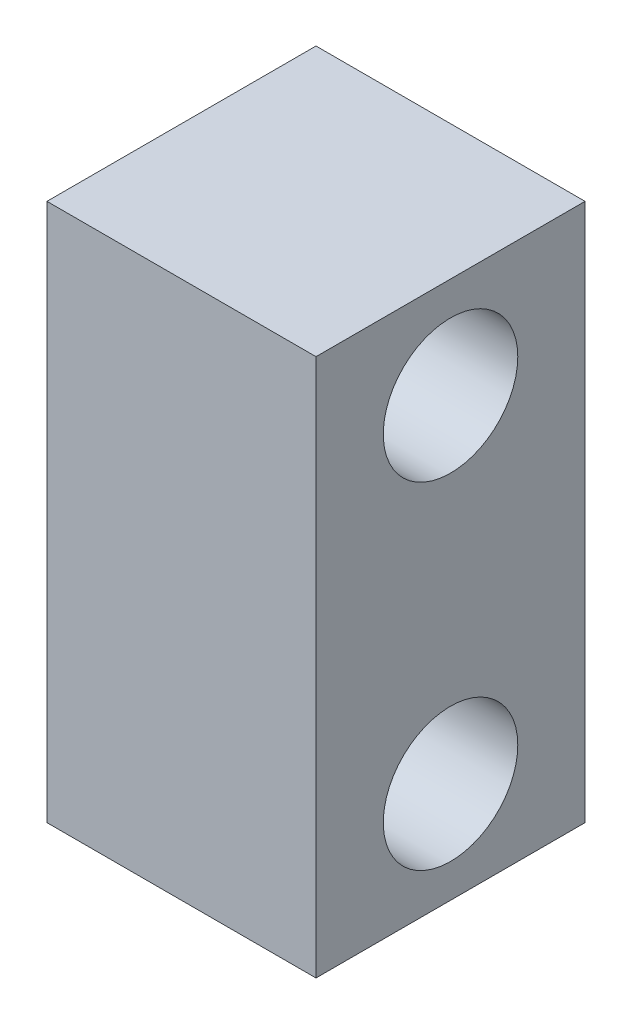
ISO-10303-21;
HEADER;
FILE_DESCRIPTION(('STEP AP214'),'2;1');
FILE_NAME('part.step','',(''),(''),'','','');
FILE_SCHEMA(('AUTOMOTIVE_DESIGN { 1 0 10303 214 1 1 1 1 }'));
ENDSEC;
DATA;
#1=APPLICATION_CONTEXT('core data for automotive mechanical design processes');
#2=APPLICATION_PROTOCOL_DEFINITION('international standard','automotive_design',2000,#1);
#3=PRODUCT_CONTEXT('',#1,'mechanical');
#4=PRODUCT('Part','Part','',(#3));
#5=PRODUCT_RELATED_PRODUCT_CATEGORY('part','',(#4));
#6=PRODUCT_DEFINITION_FORMATION('','',#4);
#7=PRODUCT_DEFINITION_CONTEXT('part definition',#1,'design');
#8=PRODUCT_DEFINITION('design','',#6,#7);
#9=PRODUCT_DEFINITION_SHAPE('','',#8);
#10=(LENGTH_UNIT() NAMED_UNIT(*) SI_UNIT(.MILLI.,.METRE.));
#11=(NAMED_UNIT(*) PLANE_ANGLE_UNIT() SI_UNIT($,.RADIAN.));
#12=(NAMED_UNIT(*) SI_UNIT($,.STERADIAN.) SOLID_ANGLE_UNIT());
#13=UNCERTAINTY_MEASURE_WITH_UNIT(LENGTH_MEASURE(1.E-05),#10,'distance_accuracy_value','');
#14=(GEOMETRIC_REPRESENTATION_CONTEXT(3) GLOBAL_UNCERTAINTY_ASSIGNED_CONTEXT((#13)) GLOBAL_UNIT_ASSIGNED_CONTEXT((#10,
#11,#12)) REPRESENTATION_CONTEXT('',''));
#15=CARTESIAN_POINT('',(0.,0.,0.));
#16=DIRECTION('',(0.,0.,1.));
#17=DIRECTION('',(1.,0.,0.));
#18=AXIS2_PLACEMENT_3D('',#15,#16,#17);
#19=CARTESIAN_POINT('',(0.,0.,50.8));
#20=DIRECTION('',(1.,0.,0.));
#21=DIRECTION('',(0.,0.,-1.));
#22=AXIS2_PLACEMENT_3D('',#19,#20,#21);
#23=PLANE('',#22);
#24=CARTESIAN_POINT('',(0.,82.55,25.4));
#25=DIRECTION('',(1.,0.,0.));
#26=DIRECTION('',(0.,0.,-1.));
#27=AXIS2_PLACEMENT_3D('',#24,#25,#26);
#28=CIRCLE('',#27,12.7);
#29=CARTESIAN_POINT('',(0.,82.55,12.7));
#30=VERTEX_POINT('',#29);
#31=EDGE_CURVE('E111',#30,#30,#28,.T.);
#32=ORIENTED_EDGE('',*,*,#31,.T.);
#33=EDGE_LOOP('',(#32));
#34=FACE_BOUND('',#33,.T.);
#35=CARTESIAN_POINT('',(0.,19.05,25.4));
#36=DIRECTION('',(1.,0.,0.));
#37=DIRECTION('',(0.,0.,-1.));
#38=AXIS2_PLACEMENT_3D('',#35,#36,#37);
#39=CIRCLE('',#38,12.7);
#40=CARTESIAN_POINT('',(0.,19.05,12.7));
#41=VERTEX_POINT('',#40);
#42=EDGE_CURVE('E132',#41,#41,#39,.T.);
#43=ORIENTED_EDGE('',*,*,#42,.T.);
#44=EDGE_LOOP('',(#43));
#45=FACE_BOUND('',#44,.T.);
#46=DIRECTION('',(0.,-1.,0.));
#47=VECTOR('',#46,1.);
#48=CARTESIAN_POINT('',(0.,0.,0.));
#49=LINE('',#48,#47);
#50=CARTESIAN_POINT('',(0.,101.6,0.));
#51=VERTEX_POINT('',#50);
#52=CARTESIAN_POINT('',(0.,0.,0.));
#53=VERTEX_POINT('',#52);
#54=EDGE_CURVE('E107',#51,#53,#49,.T.);
#55=ORIENTED_EDGE('',*,*,#54,.T.);
#56=DIRECTION('',(0.,0.,-1.));
#57=VECTOR('',#56,1.);
#58=CARTESIAN_POINT('',(0.,0.,50.8));
#59=LINE('',#58,#57);
#60=CARTESIAN_POINT('',(0.,0.,50.8));
#61=VERTEX_POINT('',#60);
#62=EDGE_CURVE('E11',#61,#53,#59,.T.);
#63=ORIENTED_EDGE('',*,*,#62,.F.);
#64=DIRECTION('',(0.,-1.,0.));
#65=VECTOR('',#64,1.);
#66=CARTESIAN_POINT('',(0.,0.,50.8));
#67=LINE('',#66,#65);
#68=CARTESIAN_POINT('',(0.,101.6,50.8));
#69=VERTEX_POINT('',#68);
#70=EDGE_CURVE('E91',#69,#61,#67,.T.);
#71=ORIENTED_EDGE('',*,*,#70,.F.);
#72=DIRECTION('',(0.,0.,-1.));
#73=VECTOR('',#72,1.);
#74=CARTESIAN_POINT('',(0.,101.6,50.8));
#75=LINE('',#74,#73);
#76=EDGE_CURVE('E103',#69,#51,#75,.T.);
#77=ORIENTED_EDGE('',*,*,#76,.T.);
#78=EDGE_LOOP('',(#55,#63,#71,#77));
#79=FACE_BOUND('',#78,.T.);
#80=ADVANCED_FACE('F39',(#34,#45,#79),#23,.F.);
#81=CARTESIAN_POINT('',(0.,0.,50.8));
#82=DIRECTION('',(0.,1.,0.));
#83=DIRECTION('',(0.,0.,1.));
#84=AXIS2_PLACEMENT_3D('',#81,#82,#83);
#85=PLANE('',#84);
#86=DIRECTION('',(1.,0.,0.));
#87=VECTOR('',#86,1.);
#88=CARTESIAN_POINT('',(0.,0.,0.));
#89=LINE('',#88,#87);
#90=CARTESIAN_POINT('',(50.8,0.,0.));
#91=VERTEX_POINT('',#90);
#92=EDGE_CURVE('E96',#53,#91,#89,.T.);
#93=ORIENTED_EDGE('',*,*,#92,.T.);
#94=DIRECTION('',(0.,0.,-1.));
#95=VECTOR('',#94,1.);
#96=CARTESIAN_POINT('',(50.8,0.,50.8));
#97=LINE('',#96,#95);
#98=CARTESIAN_POINT('',(50.8,0.,50.8));
#99=VERTEX_POINT('',#98);
#100=EDGE_CURVE('E48',#99,#91,#97,.T.);
#101=ORIENTED_EDGE('',*,*,#100,.F.);
#102=DIRECTION('',(1.,0.,0.));
#103=VECTOR('',#102,1.);
#104=CARTESIAN_POINT('',(0.,0.,50.8));
#105=LINE('',#104,#103);
#106=EDGE_CURVE('E86',#61,#99,#105,.T.);
#107=ORIENTED_EDGE('',*,*,#106,.F.);
#108=ORIENTED_EDGE('',*,*,#62,.T.);
#109=EDGE_LOOP('',(#93,#101,#107,#108));
#110=FACE_BOUND('',#109,.T.);
#111=ADVANCED_FACE('F95',(#110),#85,.F.);
#112=CARTESIAN_POINT('',(50.8,0.,50.8));
#113=DIRECTION('',(-1.,0.,0.));
#114=DIRECTION('',(0.,0.,1.));
#115=AXIS2_PLACEMENT_3D('',#112,#113,#114);
#116=PLANE('',#115);
#117=CARTESIAN_POINT('',(50.8,82.55,25.4));
#118=DIRECTION('',(1.,0.,0.));
#119=DIRECTION('',(0.,0.,-1.));
#120=AXIS2_PLACEMENT_3D('',#117,#118,#119);
#121=CIRCLE('',#120,12.7);
#122=CARTESIAN_POINT('',(50.8,82.55,12.7));
#123=VERTEX_POINT('',#122);
#124=EDGE_CURVE('E136',#123,#123,#121,.T.);
#125=ORIENTED_EDGE('',*,*,#124,.F.);
#126=EDGE_LOOP('',(#125));
#127=FACE_BOUND('',#126,.T.);
#128=CARTESIAN_POINT('',(50.8,19.05,25.4));
#129=DIRECTION('',(1.,0.,0.));
#130=DIRECTION('',(0.,0.,-1.));
#131=AXIS2_PLACEMENT_3D('',#128,#129,#130);
#132=CIRCLE('',#131,12.7);
#133=CARTESIAN_POINT('',(50.8,19.05,12.7));
#134=VERTEX_POINT('',#133);
#135=EDGE_CURVE('E128',#134,#134,#132,.T.);
#136=ORIENTED_EDGE('',*,*,#135,.F.);
#137=EDGE_LOOP('',(#136));
#138=FACE_BOUND('',#137,.T.);
#139=DIRECTION('',(0.,1.,0.));
#140=VECTOR('',#139,1.);
#141=CARTESIAN_POINT('',(50.8,0.,0.));
#142=LINE('',#141,#140);
#143=CARTESIAN_POINT('',(50.8,101.6,0.));
#144=VERTEX_POINT('',#143);
#145=EDGE_CURVE('E73',#91,#144,#142,.T.);
#146=ORIENTED_EDGE('',*,*,#145,.T.);
#147=DIRECTION('',(0.,0.,-1.));
#148=VECTOR('',#147,1.);
#149=CARTESIAN_POINT('',(50.8,101.6,50.8));
#150=LINE('',#149,#148);
#151=CARTESIAN_POINT('',(50.8,101.6,50.8));
#152=VERTEX_POINT('',#151);
#153=EDGE_CURVE('E98',#152,#144,#150,.T.);
#154=ORIENTED_EDGE('',*,*,#153,.F.);
#155=DIRECTION('',(0.,1.,0.));
#156=VECTOR('',#155,1.);
#157=CARTESIAN_POINT('',(50.8,0.,50.8));
#158=LINE('',#157,#156);
#159=EDGE_CURVE('E89',#99,#152,#158,.T.);
#160=ORIENTED_EDGE('',*,*,#159,.F.);
#161=ORIENTED_EDGE('',*,*,#100,.T.);
#162=EDGE_LOOP('',(#146,#154,#160,#161));
#163=FACE_BOUND('',#162,.T.);
#164=ADVANCED_FACE('F99',(#127,#138,#163),#116,.F.);
#165=CARTESIAN_POINT('',(0.,101.6,50.8));
#166=DIRECTION('',(0.,-1.,0.));
#167=DIRECTION('',(0.,0.,-1.));
#168=AXIS2_PLACEMENT_3D('',#165,#166,#167);
#169=PLANE('',#168);
#170=DIRECTION('',(-1.,0.,0.));
#171=VECTOR('',#170,1.);
#172=CARTESIAN_POINT('',(0.,101.6,0.));
#173=LINE('',#172,#171);
#174=EDGE_CURVE('E79',#144,#51,#173,.T.);
#175=ORIENTED_EDGE('',*,*,#174,.T.);
#176=ORIENTED_EDGE('',*,*,#76,.F.);
#177=DIRECTION('',(-1.,0.,0.));
#178=VECTOR('',#177,1.);
#179=CARTESIAN_POINT('',(0.,101.6,50.8));
#180=LINE('',#179,#178);
#181=EDGE_CURVE('E56',#152,#69,#180,.T.);
#182=ORIENTED_EDGE('',*,*,#181,.F.);
#183=ORIENTED_EDGE('',*,*,#153,.T.);
#184=EDGE_LOOP('',(#175,#176,#182,#183));
#185=FACE_BOUND('',#184,.T.);
#186=ADVANCED_FACE('F121',(#185),#169,.F.);
#187=CARTESIAN_POINT('',(0.,0.,50.8));
#188=DIRECTION('',(0.,0.,-1.));
#189=DIRECTION('',(-1.,0.,0.));
#190=AXIS2_PLACEMENT_3D('',#187,#188,#189);
#191=PLANE('',#190);
#192=ORIENTED_EDGE('',*,*,#70,.T.);
#193=ORIENTED_EDGE('',*,*,#106,.T.);
#194=ORIENTED_EDGE('',*,*,#159,.T.);
#195=ORIENTED_EDGE('',*,*,#181,.T.);
#196=EDGE_LOOP('',(#192,#193,#194,#195));
#197=FACE_BOUND('',#196,.T.);
#198=ADVANCED_FACE('F87',(#197),#191,.F.);
#199=CARTESIAN_POINT('',(0.,0.,0.));
#200=DIRECTION('',(0.,0.,-1.));
#201=DIRECTION('',(-1.,0.,0.));
#202=AXIS2_PLACEMENT_3D('',#199,#200,#201);
#203=PLANE('',#202);
#204=ORIENTED_EDGE('',*,*,#54,.F.);
#205=ORIENTED_EDGE('',*,*,#174,.F.);
#206=ORIENTED_EDGE('',*,*,#145,.F.);
#207=ORIENTED_EDGE('',*,*,#92,.F.);
#208=EDGE_LOOP('',(#204,#205,#206,#207));
#209=FACE_BOUND('',#208,.T.);
#210=ADVANCED_FACE('F124',(#209),#203,.T.);
#211=CARTESIAN_POINT('',(0.,19.05,25.4));
#212=DIRECTION('',(1.,0.,0.));
#213=DIRECTION('',(0.,0.,-1.));
#214=AXIS2_PLACEMENT_3D('',#211,#212,#213);
#215=CYLINDRICAL_SURFACE('',#214,12.7);
#216=ORIENTED_EDGE('',*,*,#42,.F.);
#217=EDGE_LOOP('',(#216));
#218=FACE_BOUND('',#217,.T.);
#219=ORIENTED_EDGE('',*,*,#135,.T.);
#220=EDGE_LOOP('',(#219));
#221=FACE_BOUND('',#220,.T.);
#222=ADVANCED_FACE('F149',(#218,#221),#215,.F.);
#223=CARTESIAN_POINT('',(0.,82.55,25.4));
#224=DIRECTION('',(1.,0.,0.));
#225=DIRECTION('',(0.,0.,-1.));
#226=AXIS2_PLACEMENT_3D('',#223,#224,#225);
#227=CYLINDRICAL_SURFACE('',#226,12.7);
#228=ORIENTED_EDGE('',*,*,#31,.F.);
#229=EDGE_LOOP('',(#228));
#230=FACE_BOUND('',#229,.T.);
#231=ORIENTED_EDGE('',*,*,#124,.T.);
#232=EDGE_LOOP('',(#231));
#233=FACE_BOUND('',#232,.T.);
#234=ADVANCED_FACE('F146',(#230,#233),#227,.F.);
#235=CLOSED_SHELL('',(#80,#111,#164,#186,#198,#210,#222,#234));
#236=MANIFOLD_SOLID_BREP('B2',#235);
#237=ADVANCED_BREP_SHAPE_REPRESENTATION('',(#18,#236),#14);
#238=SHAPE_DEFINITION_REPRESENTATION(#9,#237);
ENDSEC;
END-ISO-10303-21;
